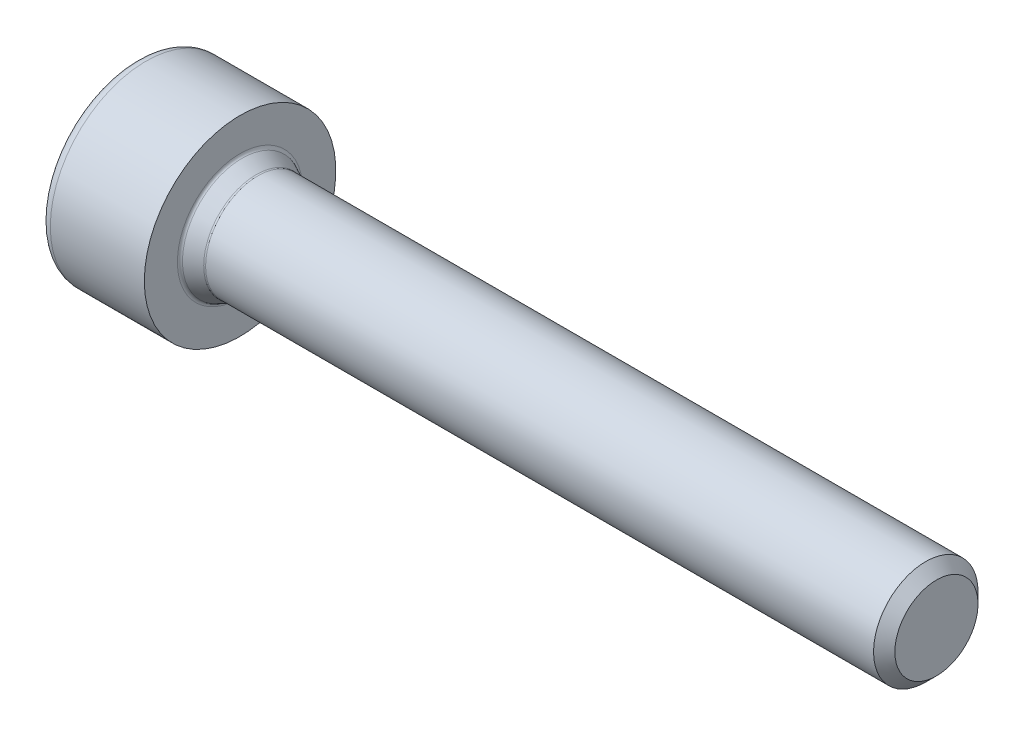
ISO-10303-21;
HEADER;
FILE_DESCRIPTION(('STEP AP214'),'2;1');
FILE_NAME('part.step','',(''),(''),'','','');
FILE_SCHEMA(('AUTOMOTIVE_DESIGN { 1 0 10303 214 1 1 1 1 }'));
ENDSEC;
DATA;
#1=APPLICATION_CONTEXT('core data for automotive mechanical design processes');
#2=APPLICATION_PROTOCOL_DEFINITION('international standard','automotive_design',2000,#1);
#3=PRODUCT_CONTEXT('',#1,'mechanical');
#4=PRODUCT('Part','Part','',(#3));
#5=PRODUCT_RELATED_PRODUCT_CATEGORY('part','',(#4));
#6=PRODUCT_DEFINITION_FORMATION('','',#4);
#7=PRODUCT_DEFINITION_CONTEXT('part definition',#1,'design');
#8=PRODUCT_DEFINITION('design','',#6,#7);
#9=PRODUCT_DEFINITION_SHAPE('','',#8);
#10=(LENGTH_UNIT() NAMED_UNIT(*) SI_UNIT(.MILLI.,.METRE.));
#11=(NAMED_UNIT(*) PLANE_ANGLE_UNIT() SI_UNIT($,.RADIAN.));
#12=(NAMED_UNIT(*) SI_UNIT($,.STERADIAN.) SOLID_ANGLE_UNIT());
#13=UNCERTAINTY_MEASURE_WITH_UNIT(LENGTH_MEASURE(1.E-05),#10,'distance_accuracy_value','');
#14=(GEOMETRIC_REPRESENTATION_CONTEXT(3) GLOBAL_UNCERTAINTY_ASSIGNED_CONTEXT((#13)) GLOBAL_UNIT_ASSIGNED_CONTEXT((#10,
#11,#12)) REPRESENTATION_CONTEXT('',''));
#15=CARTESIAN_POINT('',(0.,0.,0.));
#16=DIRECTION('',(0.,0.,1.));
#17=DIRECTION('',(1.,0.,0.));
#18=AXIS2_PLACEMENT_3D('',#15,#16,#17);
#19=CARTESIAN_POINT('',(-1.15,1.44337567297406,0.));
#20=DIRECTION('',(0.,0.866025403784439,0.5));
#21=DIRECTION('',(0.,-0.5,0.866025403784439));
#22=AXIS2_PLACEMENT_3D('',#19,#20,#21);
#23=PLANE('',#22);
#24=DIRECTION('',(1.,0.,0.));
#25=VECTOR('',#24,1.);
#26=CARTESIAN_POINT('',(-1.15,1.44337567297406,0.));
#27=LINE('',#26,#25);
#28=CARTESIAN_POINT('',(-3.,1.44337567297406,0.));
#29=VERTEX_POINT('',#28);
#30=CARTESIAN_POINT('',(-1.15,1.44337567297406,0.));
#31=VERTEX_POINT('',#30);
#32=EDGE_CURVE('E113',#29,#31,#27,.T.);
#33=ORIENTED_EDGE('',*,*,#32,.T.);
#34=DIRECTION('',(0.,-0.5,0.866025403784439));
#35=VECTOR('',#34,1.);
#36=CARTESIAN_POINT('',(-1.15,1.44337567297406,0.));
#37=LINE('',#36,#35);
#38=CARTESIAN_POINT('',(-1.15,0.721687836487032,1.25));
#39=VERTEX_POINT('',#38);
#40=EDGE_CURVE('E101',#39,#31,#37,.F.);
#41=ORIENTED_EDGE('',*,*,#40,.F.);
#42=DIRECTION('',(1.,0.,0.));
#43=VECTOR('',#42,1.);
#44=CARTESIAN_POINT('',(-1.15,0.721687836487032,1.25));
#45=LINE('',#44,#43);
#46=CARTESIAN_POINT('',(-3.,0.721687836487032,1.25));
#47=VERTEX_POINT('',#46);
#48=EDGE_CURVE('E99',#39,#47,#45,.F.);
#49=ORIENTED_EDGE('',*,*,#48,.T.);
#50=DIRECTION('',(0.,-0.5,0.866025403784439));
#51=VECTOR('',#50,1.);
#52=CARTESIAN_POINT('',(-3.,1.44337567297406,0.));
#53=LINE('',#52,#51);
#54=CARTESIAN_POINT('',(-3.00000000001217,0.730138153725119,1.23536362120356));
#55=VERTEX_POINT('',#54);
#56=EDGE_CURVE('E88',#55,#47,#53,.T.);
#57=ORIENTED_EDGE('',*,*,#56,.F.);
#58=CARTESIAN_POINT('',(-2.99999999998104,1.43492535570608,0.0146363788507577));
#59=CARTESIAN_POINT('',(-2.97614422369758,1.41061933872002,0.0567356351986281));
#60=CARTESIAN_POINT('',(-2.95372895410129,1.38591202091713,0.0995299649513145));
#61=CARTESIAN_POINT('',(-2.91275824019961,1.33556014659485,0.186741969533327));
#62=CARTESIAN_POINT('',(-2.89422444681304,1.30991122428466,0.231167206134148));
#63=CARTESIAN_POINT('',(-2.86251893332919,1.25819744032306,0.320738107407409));
#64=CARTESIAN_POINT('',(-2.84927080537774,1.2321446250199,0.365862907192652));
#65=CARTESIAN_POINT('',(-2.82890288179569,1.17948997052625,0.457063444030607));
#66=CARTESIAN_POINT('',(-2.82176877882099,1.15288956308614,0.503136701218909));
#67=CARTESIAN_POINT('',(-2.81531818799297,1.10662680515451,0.583266148454772));
#68=CARTESIAN_POINT('',(-2.81441787116884,1.08701763674765,0.617230224429627));
#69=CARTESIAN_POINT('',(-2.81631201717714,1.04783836523914,0.685090713285895));
#70=CARTESIAN_POINT('',(-2.81910735784838,1.02826827252522,0.718987108175235));
#71=CARTESIAN_POINT('',(-2.82823104113181,0.989322680676551,0.786442851987974));
#72=CARTESIAN_POINT('',(-2.83456230525513,0.969947355960118,0.82000189880998));
#73=CARTESIAN_POINT('',(-2.85041837518595,0.931522584480777,0.886555555281422));
#74=CARTESIAN_POINT('',(-2.85994451235766,0.912473277059478,0.91954992358411));
#75=CARTESIAN_POINT('',(-2.88717720353795,0.865404269274825,1.00107583652899));
#76=CARTESIAN_POINT('',(-2.9065958401645,0.837635822929059,1.0491721964471));
#77=CARTESIAN_POINT('',(-2.95013015716089,0.783131175523178,1.14357701500272));
#78=CARTESIAN_POINT('',(-2.97423015985955,0.756391876443108,1.18989083956818));
#79=CARTESIAN_POINT('',(-2.99999999998164,0.7301381537562,1.23536362114972));
#80=B_SPLINE_CURVE_WITH_KNOTS('',3,(#58,#59,#60,#61,#62,#63,#64,#65,#66,#67,#68,#69,#70,#71,#72,
#73,#74,#75,#76,#77,#78,#79),.UNSPECIFIED.,.F.,.F.,(4,2,2,2,2,2,2,2,2,2,4),(0.,0.16255676109928,
0.325997439633078,0.486981513157489,0.647587833378342,0.765107082751543,0.88265425178377,
1.00029868663939,1.11799220720352,1.2942288438708,1.46988514303168),.UNSPECIFIED.);
#81=CARTESIAN_POINT('',(-3.00000000002137,1.43492535574535,0.0146363787802106));
#82=VERTEX_POINT('',#81);
#83=EDGE_CURVE('E19',#82,#55,#80,.T.);
#84=ORIENTED_EDGE('',*,*,#83,.F.);
#85=DIRECTION('',(0.,-0.5,0.866025403784439));
#86=VECTOR('',#85,1.);
#87=CARTESIAN_POINT('',(-3.,1.44337567297406,0.));
#88=LINE('',#87,#86);
#89=EDGE_CURVE('E79',#29,#82,#88,.T.);
#90=ORIENTED_EDGE('',*,*,#89,.F.);
#91=EDGE_LOOP('',(#33,#41,#49,#57,#84,#90));
#92=FACE_BOUND('',#91,.T.);
#93=ADVANCED_FACE('F15',(#92),#23,.F.);
#94=CARTESIAN_POINT('',(-1.15,0.721687836487032,-1.25));
#95=DIRECTION('',(0.,0.866025403784439,-0.5));
#96=DIRECTION('',(0.,0.5,0.866025403784439));
#97=AXIS2_PLACEMENT_3D('',#94,#95,#96);
#98=PLANE('',#97);
#99=DIRECTION('',(-1.,0.,0.));
#100=VECTOR('',#99,1.);
#101=CARTESIAN_POINT('',(-1.15,0.721687836487032,-1.25));
#102=LINE('',#101,#100);
#103=CARTESIAN_POINT('',(-3.,0.721687836487032,-1.25));
#104=VERTEX_POINT('',#103);
#105=CARTESIAN_POINT('',(-1.15,0.721687836487032,-1.25));
#106=VERTEX_POINT('',#105);
#107=EDGE_CURVE('E333',#104,#106,#102,.F.);
#108=ORIENTED_EDGE('',*,*,#107,.T.);
#109=DIRECTION('',(0.,0.5,0.866025403784439));
#110=VECTOR('',#109,1.);
#111=CARTESIAN_POINT('',(-1.15,0.721687836487032,-1.25));
#112=LINE('',#111,#110);
#113=EDGE_CURVE('E115',#31,#106,#112,.F.);
#114=ORIENTED_EDGE('',*,*,#113,.F.);
#115=ORIENTED_EDGE('',*,*,#32,.F.);
#116=DIRECTION('',(0.,0.5,0.866025403784439));
#117=VECTOR('',#116,1.);
#118=CARTESIAN_POINT('',(-3.,0.721687836487032,-1.25));
#119=LINE('',#118,#117);
#120=CARTESIAN_POINT('',(-3.00000000001217,1.43492535573598,-0.0146363787964418));
#121=VERTEX_POINT('',#120);
#122=EDGE_CURVE('E116',#121,#29,#119,.T.);
#123=ORIENTED_EDGE('',*,*,#122,.F.);
#124=CARTESIAN_POINT('',(-2.99999999998104,0.73013815375721,-1.23536362115051));
#125=CARTESIAN_POINT('',(-2.97614422369758,0.754444170741868,-1.19326436480183));
#126=CARTESIAN_POINT('',(-2.95372895410129,0.779151488544179,-1.15047003504881));
#127=CARTESIAN_POINT('',(-2.91275824019961,0.829503362866029,-1.06325803046655));
#128=CARTESIAN_POINT('',(-2.89422444681304,0.855152285176378,-1.01883279386582));
#129=CARTESIAN_POINT('',(-2.86251893332919,0.90686606913809,-0.929261892592623));
#130=CARTESIAN_POINT('',(-2.84927080537774,0.932918884441215,-0.884137092807356));
#131=CARTESIAN_POINT('',(-2.82890288179569,0.985573538934836,-0.792936555969384));
#132=CARTESIAN_POINT('',(-2.82176877882099,1.01217394637495,-0.746863298781089));
#133=CARTESIAN_POINT('',(-2.81531818799297,1.05843670430659,-0.666733851545229));
#134=CARTESIAN_POINT('',(-2.81441787116884,1.07804587271345,-0.632769775570373));
#135=CARTESIAN_POINT('',(-2.81631201717714,1.11722514422196,-0.564909286714104));
#136=CARTESIAN_POINT('',(-2.81910735784838,1.13679523693588,-0.531012891824764));
#137=CARTESIAN_POINT('',(-2.82823104113181,1.17574082878455,-0.463557148012026));
#138=CARTESIAN_POINT('',(-2.83456230525513,1.19511615350098,-0.42999810119002));
#139=CARTESIAN_POINT('',(-2.85041837518595,1.23354092498032,-0.363444444718578));
#140=CARTESIAN_POINT('',(-2.85994451235766,1.25259023240162,-0.330450076415889));
#141=CARTESIAN_POINT('',(-2.88717720353795,1.29965924018627,-0.248924163471014));
#142=CARTESIAN_POINT('',(-2.9065958401645,1.32742768653204,-0.200827803552898));
#143=CARTESIAN_POINT('',(-2.95013015716089,1.38193233393792,-0.106422984997284));
#144=CARTESIAN_POINT('',(-2.97423015985955,1.40867163301799,-0.0601091604318232));
#145=CARTESIAN_POINT('',(-2.99999999998164,1.4349253557049,-0.0146363788502751));
#146=B_SPLINE_CURVE_WITH_KNOTS('',3,(#124,#125,#126,#127,#128,#129,#130,#131,#132,#133,#134,
#135,#136,#137,#138,#139,#140,#141,#142,#143,#144,#145),.UNSPECIFIED.,.F.,.F.,(4,2,2,2,2,2,2,2,
2,2,4),(0.,0.16255676109928,0.325997439633078,0.48698151315749,0.647587833378342,
0.765107082751544,0.88265425178377,1.00029868663939,1.11799220720352,1.2942288438708,
1.46988514303168),.UNSPECIFIED.);
#147=CARTESIAN_POINT('',(-3.00000000002137,0.730138153715748,-1.23536362121979));
#148=VERTEX_POINT('',#147);
#149=EDGE_CURVE('E193',#148,#121,#146,.T.);
#150=ORIENTED_EDGE('',*,*,#149,.F.);
#151=DIRECTION('',(0.,0.5,0.866025403784439));
#152=VECTOR('',#151,1.);
#153=CARTESIAN_POINT('',(-3.,0.721687836487032,-1.25));
#154=LINE('',#153,#152);
#155=EDGE_CURVE('E357',#104,#148,#154,.T.);
#156=ORIENTED_EDGE('',*,*,#155,.F.);
#157=EDGE_LOOP('',(#108,#114,#115,#123,#150,#156));
#158=FACE_BOUND('',#157,.T.);
#159=ADVANCED_FACE('F207',(#158),#98,.F.);
#160=CARTESIAN_POINT('',(-0.462678250983117,0.,-5.6843418860808E-11));
#161=DIRECTION('',(-1.,0.,0.));
#162=DIRECTION('',(0.,0.,1.));
#163=AXIS2_PLACEMENT_3D('',#160,#161,#162);
#164=CONICAL_SURFACE('',#163,0.,1.04719755120469);
#165=CARTESIAN_POINT('',(-0.462678250983117,0.,0.));
#166=VERTEX_POINT('',#165);
#167=VERTEX_LOOP('',#166);
#168=FACE_BOUND('',#167,.T.);
#169=CARTESIAN_POINT('',(-1.14999999999554,0.,-5.6843418860808E-11));
#170=DIRECTION('',(-1.,0.,0.));
#171=DIRECTION('',(0.,0.,1.));
#172=AXIS2_PLACEMENT_3D('',#169,#170,#171);
#173=CIRCLE('',#172,1.19047619045887);
#174=CARTESIAN_POINT('',(-1.14999999999554,0.,1.19047619040202));
#175=VERTEX_POINT('',#174);
#176=EDGE_CURVE('E328',#175,#175,#173,.T.);
#177=ORIENTED_EDGE('',*,*,#176,.T.);
#178=EDGE_LOOP('',(#177));
#179=FACE_BOUND('',#178,.T.);
#180=ADVANCED_FACE('F202',(#168,#179),#164,.F.);
#181=CARTESIAN_POINT('',(-1.15,0.721687836487032,1.25));
#182=DIRECTION('',(0.,0.,1.));
#183=DIRECTION('',(1.,0.,0.));
#184=AXIS2_PLACEMENT_3D('',#181,#182,#183);
#185=PLANE('',#184);
#186=CARTESIAN_POINT('',(-2.99999999998104,0.704787201948871,1.25000000000127));
#187=CARTESIAN_POINT('',(-2.97614422369758,0.65617516797815,1.25000000000046));
#188=CARTESIAN_POINT('',(-2.95372895410129,0.606760532372951,1.25000000000012));
#189=CARTESIAN_POINT('',(-2.91275824019961,0.506056783728826,1.24999999999988));
#190=CARTESIAN_POINT('',(-2.89422444681304,0.454758939108285,1.24999999999997));
#191=CARTESIAN_POINT('',(-2.86251893332919,0.351331371184973,1.25000000000003));
#192=CARTESIAN_POINT('',(-2.84927080537774,0.299225740578682,1.25000000000001));
#193=CARTESIAN_POINT('',(-2.82890288179569,0.19391643159141,1.24999999999999));
#194=CARTESIAN_POINT('',(-2.82176877882099,0.140715616711196,1.25));
#195=CARTESIAN_POINT('',(-2.81531818799297,0.0481901008479147,1.25));
#196=CARTESIAN_POINT('',(-2.81441787116884,0.00897176403419511,1.25));
#197=CARTESIAN_POINT('',(-2.81631201717714,-0.0693867789828172,1.25));
#198=CARTESIAN_POINT('',(-2.81910735784838,-0.108526964410654,1.25));
#199=CARTESIAN_POINT('',(-2.82823104113181,-0.186418148107996,1.25));
#200=CARTESIAN_POINT('',(-2.83456230525513,-0.225168797540861,1.25));
#201=CARTESIAN_POINT('',(-2.85041837518595,-0.302018340499543,1.25));
#202=CARTESIAN_POINT('',(-2.85994451235766,-0.34011695534214,1.25));
#203=CARTESIAN_POINT('',(-2.88717720353795,-0.434254970911448,1.25));
#204=CARTESIAN_POINT('',(-2.9065958401645,-0.489791863602979,1.25));
#205=CARTESIAN_POINT('',(-2.95013015716089,-0.598801158414741,1.25));
#206=CARTESIAN_POINT('',(-2.97423015985955,-0.652279756574881,1.25));
#207=CARTESIAN_POINT('',(-2.99999999998164,-0.704787201948696,1.25));
#208=B_SPLINE_CURVE_WITH_KNOTS('',3,(#186,#187,#188,#189,#190,#191,#192,#193,#194,#195,#196,
#197,#198,#199,#200,#201,#202,#203,#204,#205,#206,#207),.UNSPECIFIED.,.F.,.F.,(4,2,2,2,2,2,2,2,
2,2,4),(0.,0.16255676109928,0.325997439633078,0.48698151315749,0.647587833378342,
0.765107082751544,0.88265425178377,1.00029868663939,1.11799220720352,1.2942288438708,
1.46988514303168),.UNSPECIFIED.);
#209=CARTESIAN_POINT('',(-3.00000000002137,0.7047872020296,1.25));
#210=VERTEX_POINT('',#209);
#211=CARTESIAN_POINT('',(-3.00000000001217,-0.704787202010858,1.25));
#212=VERTEX_POINT('',#211);
#213=EDGE_CURVE('E180',#210,#212,#208,.T.);
#214=ORIENTED_EDGE('',*,*,#213,.F.);
#215=DIRECTION('',(0.,1.,0.));
#216=VECTOR('',#215,1.);
#217=CARTESIAN_POINT('',(-3.,0.721687836487032,1.25));
#218=LINE('',#217,#216);
#219=EDGE_CURVE('E187',#47,#210,#218,.F.);
#220=ORIENTED_EDGE('',*,*,#219,.F.);
#221=ORIENTED_EDGE('',*,*,#48,.F.);
#222=DIRECTION('',(0.,1.,0.));
#223=VECTOR('',#222,1.);
#224=CARTESIAN_POINT('',(-1.15,0.,1.25));
#225=LINE('',#224,#223);
#226=CARTESIAN_POINT('',(-1.15,-0.721687836487032,1.25));
#227=VERTEX_POINT('',#226);
#228=EDGE_CURVE('E318',#39,#227,#225,.F.);
#229=ORIENTED_EDGE('',*,*,#228,.T.);
#230=DIRECTION('',(1.,0.,0.));
#231=VECTOR('',#230,1.);
#232=CARTESIAN_POINT('',(-1.15,-0.721687836487032,1.25));
#233=LINE('',#232,#231);
#234=CARTESIAN_POINT('',(-3.,-0.721687836487032,1.25));
#235=VERTEX_POINT('',#234);
#236=EDGE_CURVE('E312',#227,#235,#233,.F.);
#237=ORIENTED_EDGE('',*,*,#236,.T.);
#238=DIRECTION('',(0.,1.,0.));
#239=VECTOR('',#238,1.);
#240=CARTESIAN_POINT('',(-3.,0.721687836487032,1.25));
#241=LINE('',#240,#239);
#242=EDGE_CURVE('E186',#212,#235,#241,.F.);
#243=ORIENTED_EDGE('',*,*,#242,.F.);
#244=EDGE_LOOP('',(#214,#220,#221,#229,#237,#243));
#245=FACE_BOUND('',#244,.T.);
#246=ADVANCED_FACE('F197',(#245),#185,.F.);
#247=CARTESIAN_POINT('',(-1.15,-0.721687836487032,-1.25));
#248=DIRECTION('',(0.,0.,-1.));
#249=DIRECTION('',(-1.,0.,0.));
#250=AXIS2_PLACEMENT_3D('',#247,#248,#249);
#251=PLANE('',#250);
#252=DIRECTION('',(1.,0.,0.));
#253=VECTOR('',#252,1.);
#254=CARTESIAN_POINT('',(-1.15,-0.721687836487032,-1.25));
#255=LINE('',#254,#253);
#256=CARTESIAN_POINT('',(-3.,-0.721687836487032,-1.25));
#257=VERTEX_POINT('',#256);
#258=CARTESIAN_POINT('',(-1.15,-0.721687836487032,-1.25));
#259=VERTEX_POINT('',#258);
#260=EDGE_CURVE('E296',#257,#259,#255,.T.);
#261=ORIENTED_EDGE('',*,*,#260,.T.);
#262=DIRECTION('',(0.,1.,0.));
#263=VECTOR('',#262,1.);
#264=CARTESIAN_POINT('',(-1.15,0.,-1.25));
#265=LINE('',#264,#263);
#266=EDGE_CURVE('E325',#259,#106,#265,.T.);
#267=ORIENTED_EDGE('',*,*,#266,.T.);
#268=ORIENTED_EDGE('',*,*,#107,.F.);
#269=DIRECTION('',(0.,1.,0.));
#270=VECTOR('',#269,1.);
#271=CARTESIAN_POINT('',(-3.,-0.721687836487032,-1.25));
#272=LINE('',#271,#270);
#273=CARTESIAN_POINT('',(-3.00000000001217,0.704787202010857,-1.25));
#274=VERTEX_POINT('',#273);
#275=EDGE_CURVE('E336',#274,#104,#272,.T.);
#276=ORIENTED_EDGE('',*,*,#275,.F.);
#277=CARTESIAN_POINT('',(-2.99999999998104,-0.70478720194887,-1.25000000000127));
#278=CARTESIAN_POINT('',(-2.97614422369758,-0.65617516797815,-1.25000000000046));
#279=CARTESIAN_POINT('',(-2.95372895410129,-0.606760532372951,-1.25000000000012));
#280=CARTESIAN_POINT('',(-2.91275824019961,-0.506056783728825,-1.24999999999988));
#281=CARTESIAN_POINT('',(-2.89422444681304,-0.454758939108284,-1.24999999999997));
#282=CARTESIAN_POINT('',(-2.86251893332919,-0.351331371184972,-1.25000000000003));
#283=CARTESIAN_POINT('',(-2.84927080537774,-0.299225740578682,-1.25000000000001));
#284=CARTESIAN_POINT('',(-2.82890288179569,-0.19391643159141,-1.24999999999999));
#285=CARTESIAN_POINT('',(-2.82176877882099,-0.140715616711196,-1.25));
#286=CARTESIAN_POINT('',(-2.81531818799297,-0.048190100847915,-1.25));
#287=CARTESIAN_POINT('',(-2.81441787116884,-0.0089717640341955,-1.25));
#288=CARTESIAN_POINT('',(-2.81631201717714,0.0693867789828167,-1.25));
#289=CARTESIAN_POINT('',(-2.81910735784838,0.108526964410654,-1.25));
#290=CARTESIAN_POINT('',(-2.82823104113181,0.186418148107996,-1.25));
#291=CARTESIAN_POINT('',(-2.83456230525513,0.225168797540861,-1.25));
#292=CARTESIAN_POINT('',(-2.85041837518595,0.302018340499543,-1.25));
#293=CARTESIAN_POINT('',(-2.85994451235766,0.34011695534214,-1.25));
#294=CARTESIAN_POINT('',(-2.88717720353795,0.434254970911448,-1.25));
#295=CARTESIAN_POINT('',(-2.9065958401645,0.489791863602978,-1.25));
#296=CARTESIAN_POINT('',(-2.95013015716089,0.598801158414741,-1.25));
#297=CARTESIAN_POINT('',(-2.97423015985955,0.652279756574881,-1.25));
#298=CARTESIAN_POINT('',(-2.99999999998164,0.704787201948696,-1.25));
#299=B_SPLINE_CURVE_WITH_KNOTS('',3,(#277,#278,#279,#280,#281,#282,#283,#284,#285,#286,#287,
#288,#289,#290,#291,#292,#293,#294,#295,#296,#297,#298),.UNSPECIFIED.,.F.,.F.,(4,2,2,2,2,2,2,2,
2,2,4),(0.,0.16255676109928,0.325997439633078,0.486981513157489,0.647587833378342,
0.765107082751543,0.88265425178377,1.00029868663939,1.11799220720352,1.2942288438708,
1.46988514303168),.UNSPECIFIED.);
#300=CARTESIAN_POINT('',(-3.00000000002137,-0.7047872020296,-1.25));
#301=VERTEX_POINT('',#300);
#302=EDGE_CURVE('E188',#301,#274,#299,.T.);
#303=ORIENTED_EDGE('',*,*,#302,.F.);
#304=DIRECTION('',(0.,1.,0.));
#305=VECTOR('',#304,1.);
#306=CARTESIAN_POINT('',(-3.,-0.721687836487032,-1.25));
#307=LINE('',#306,#305);
#308=EDGE_CURVE('E331',#257,#301,#307,.T.);
#309=ORIENTED_EDGE('',*,*,#308,.F.);
#310=EDGE_LOOP('',(#261,#267,#268,#276,#303,#309));
#311=FACE_BOUND('',#310,.T.);
#312=ADVANCED_FACE('F201',(#311),#251,.F.);
#313=CARTESIAN_POINT('',(-1.15,0.,0.));
#314=DIRECTION('',(1.,0.,0.));
#315=DIRECTION('',(0.,0.,-1.));
#316=AXIS2_PLACEMENT_3D('',#313,#314,#315);
#317=PLANE('',#316);
#318=ORIENTED_EDGE('',*,*,#40,.T.);
#319=ORIENTED_EDGE('',*,*,#113,.T.);
#320=ORIENTED_EDGE('',*,*,#266,.F.);
#321=DIRECTION('',(0.,0.5,-0.866025403784439));
#322=VECTOR('',#321,1.);
#323=CARTESIAN_POINT('',(-1.15,-1.44337567297406,0.));
#324=LINE('',#323,#322);
#325=CARTESIAN_POINT('',(-1.15,-1.44337567297406,0.));
#326=VERTEX_POINT('',#325);
#327=EDGE_CURVE('E299',#259,#326,#324,.F.);
#328=ORIENTED_EDGE('',*,*,#327,.T.);
#329=DIRECTION('',(0.,-0.5,-0.866025403784439));
#330=VECTOR('',#329,1.);
#331=CARTESIAN_POINT('',(-1.15,-0.721687836487032,1.25));
#332=LINE('',#331,#330);
#333=EDGE_CURVE('E315',#326,#227,#332,.F.);
#334=ORIENTED_EDGE('',*,*,#333,.T.);
#335=ORIENTED_EDGE('',*,*,#228,.F.);
#336=EDGE_LOOP('',(#318,#319,#320,#328,#334,#335));
#337=FACE_BOUND('',#336,.T.);
#338=ORIENTED_EDGE('',*,*,#176,.F.);
#339=EDGE_LOOP('',(#338));
#340=FACE_BOUND('',#339,.T.);
#341=ADVANCED_FACE('F417',(#337,#340),#317,.F.);
#342=CARTESIAN_POINT('',(-1.15,-0.721687836487032,1.25));
#343=DIRECTION('',(0.,-0.866025403784439,0.5));
#344=DIRECTION('',(0.,-0.5,-0.866025403784439));
#345=AXIS2_PLACEMENT_3D('',#342,#343,#344);
#346=PLANE('',#345);
#347=CARTESIAN_POINT('',(-2.99999999998104,-0.73013815375721,1.23536362115051));
#348=CARTESIAN_POINT('',(-2.97614422369758,-0.754444170741868,1.19326436480183));
#349=CARTESIAN_POINT('',(-2.95372895410129,-0.779151488544179,1.15047003504881));
#350=CARTESIAN_POINT('',(-2.91275824019961,-0.829503362866029,1.06325803046655));
#351=CARTESIAN_POINT('',(-2.89422444681304,-0.855152285176378,1.01883279386582));
#352=CARTESIAN_POINT('',(-2.86251893332919,-0.90686606913809,0.929261892592623));
#353=CARTESIAN_POINT('',(-2.84927080537774,-0.932918884441215,0.884137092807355));
#354=CARTESIAN_POINT('',(-2.82890288179569,-0.985573538934836,0.792936555969384));
#355=CARTESIAN_POINT('',(-2.82176877882099,-1.01217394637495,0.746863298781089));
#356=CARTESIAN_POINT('',(-2.81531818799297,-1.05843670430659,0.666733851545229));
#357=CARTESIAN_POINT('',(-2.81441787116884,-1.07804587271345,0.632769775570373));
#358=CARTESIAN_POINT('',(-2.81631201717714,-1.11722514422196,0.564909286714104));
#359=CARTESIAN_POINT('',(-2.81910735784838,-1.13679523693588,0.531012891824764));
#360=CARTESIAN_POINT('',(-2.82823104113181,-1.17574082878455,0.463557148012026));
#361=CARTESIAN_POINT('',(-2.83456230525513,-1.19511615350098,0.429998101190019));
#362=CARTESIAN_POINT('',(-2.85041837518595,-1.23354092498032,0.363444444718577));
#363=CARTESIAN_POINT('',(-2.85994451235766,-1.25259023240162,0.330450076415889));
#364=CARTESIAN_POINT('',(-2.88717720353795,-1.29965924018627,0.248924163471014));
#365=CARTESIAN_POINT('',(-2.9065958401645,-1.32742768653204,0.200827803552898));
#366=CARTESIAN_POINT('',(-2.95013015716089,-1.38193233393792,0.106422984997284));
#367=CARTESIAN_POINT('',(-2.97423015985955,-1.40867163301799,0.0601091604318233));
#368=CARTESIAN_POINT('',(-2.99999999998164,-1.4349253557049,0.0146363788502754));
#369=B_SPLINE_CURVE_WITH_KNOTS('',3,(#347,#348,#349,#350,#351,#352,#353,#354,#355,#356,#357,
#358,#359,#360,#361,#362,#363,#364,#365,#366,#367,#368),.UNSPECIFIED.,.F.,.F.,(4,2,2,2,2,2,2,2,
2,2,4),(0.,0.16255676109928,0.325997439633078,0.48698151315749,0.647587833378343,
0.765107082751544,0.882654251783771,1.00029868663939,1.11799220720353,1.2942288438708,
1.46988514303168),.UNSPECIFIED.);
#370=CARTESIAN_POINT('',(-3.00000000002137,-0.730138153715748,1.23536362121979));
#371=VERTEX_POINT('',#370);
#372=CARTESIAN_POINT('',(-3.00000000001217,-1.43492535573598,0.0146363787964418));
#373=VERTEX_POINT('',#372);
#374=EDGE_CURVE('E151',#371,#373,#369,.T.);
#375=ORIENTED_EDGE('',*,*,#374,.F.);
#376=DIRECTION('',(0.,-0.5,-0.866025403784439));
#377=VECTOR('',#376,1.);
#378=CARTESIAN_POINT('',(-3.,-0.721687836487032,1.25));
#379=LINE('',#378,#377);
#380=EDGE_CURVE('E310',#235,#371,#379,.T.);
#381=ORIENTED_EDGE('',*,*,#380,.F.);
#382=ORIENTED_EDGE('',*,*,#236,.F.);
#383=ORIENTED_EDGE('',*,*,#333,.F.);
#384=DIRECTION('',(1.,0.,0.));
#385=VECTOR('',#384,1.);
#386=CARTESIAN_POINT('',(-1.15,-1.44337567297406,0.));
#387=LINE('',#386,#385);
#388=CARTESIAN_POINT('',(-3.,-1.44337567297406,0.));
#389=VERTEX_POINT('',#388);
#390=EDGE_CURVE('E293',#326,#389,#387,.F.);
#391=ORIENTED_EDGE('',*,*,#390,.T.);
#392=DIRECTION('',(0.,-0.5,-0.866025403784439));
#393=VECTOR('',#392,1.);
#394=CARTESIAN_POINT('',(-3.,-0.721687836487032,1.25));
#395=LINE('',#394,#393);
#396=EDGE_CURVE('E300',#373,#389,#395,.T.);
#397=ORIENTED_EDGE('',*,*,#396,.F.);
#398=EDGE_LOOP('',(#375,#381,#382,#383,#391,#397));
#399=FACE_BOUND('',#398,.T.);
#400=ADVANCED_FACE('F425',(#399),#346,.F.);
#401=CARTESIAN_POINT('',(-1.15,-1.44337567297406,0.));
#402=DIRECTION('',(0.,-0.866025403784439,-0.5));
#403=DIRECTION('',(0.,0.5,-0.866025403784439));
#404=AXIS2_PLACEMENT_3D('',#401,#402,#403);
#405=PLANE('',#404);
#406=CARTESIAN_POINT('',(-2.99999999998326,-1.4349253557153,-0.014636378844587));
#407=CARTESIAN_POINT('',(-2.97614422370064,-1.41061933872587,-0.0567356351920171));
#408=CARTESIAN_POINT('',(-2.95372895410438,-1.38591202092139,-0.0995299649448835));
#409=CARTESIAN_POINT('',(-2.9127582402021,-1.33556014659746,-0.186741969527869));
#410=CARTESIAN_POINT('',(-2.89422444681489,-1.30991122428721,-0.231167206129487));
#411=CARTESIAN_POINT('',(-2.86251893333011,-1.25819744032504,-0.320738107404241));
#412=CARTESIAN_POINT('',(-2.84927080537836,-1.23214462502136,-0.365862907190182));
#413=CARTESIAN_POINT('',(-2.82890288179585,-1.17948997052679,-0.457063444029594));
#414=CARTESIAN_POINT('',(-2.82176877882099,-1.15288956308628,-0.503136701218656));
#415=CARTESIAN_POINT('',(-2.81531818799294,-1.10662680515418,-0.583266148455357));
#416=CARTESIAN_POINT('',(-2.81441787116883,-1.08701763674727,-0.617230224430288));
#417=CARTESIAN_POINT('',(-2.81631201717718,-1.04783836523867,-0.685090713286707));
#418=CARTESIAN_POINT('',(-2.81910735784847,-1.02826827252471,-0.718987108176123));
#419=CARTESIAN_POINT('',(-2.82823104113198,-0.989322680675957,-0.786442851989003));
#420=CARTESIAN_POINT('',(-2.83456230525535,-0.969947355959487,-0.820001898811074));
#421=CARTESIAN_POINT('',(-2.85041837518628,-0.931522584480073,-0.886555555282642));
#422=CARTESIAN_POINT('',(-2.85994451235805,-0.912473277058739,-0.919549923585391));
#423=CARTESIAN_POINT('',(-2.88717720353886,-0.865404269273364,-1.00107583653152));
#424=CARTESIAN_POINT('',(-2.90659584016601,-0.837635822926935,-1.04917219645078));
#425=CARTESIAN_POINT('',(-2.95013015716381,-0.783131175519765,-1.14357701500863));
#426=CARTESIAN_POINT('',(-2.97423015986326,-0.75639187643907,-1.18989083957517));
#427=CARTESIAN_POINT('',(-2.9999999999862,-0.73013815375156,-1.23536362115776));
#428=B_SPLINE_CURVE_WITH_KNOTS('',3,(#406,#407,#408,#409,#410,#411,#412,#413,#414,#415,#416,
#417,#418,#419,#420,#421,#422,#423,#424,#425,#426,#427),.UNSPECIFIED.,.F.,.F.,(4,2,2,2,2,2,2,2,
2,2,4),(0.,0.162556761101842,0.325997439638349,0.486981513165443,0.647587833388914,
0.76510708276238,0.882654251794874,1.00029868665074,1.11799220721512,1.29422884388674,
1.469885143052),.UNSPECIFIED.);
#429=CARTESIAN_POINT('',(-3.00000000001435,-1.4349253557382,-0.0146363787925877));
#430=VERTEX_POINT('',#429);
#431=CARTESIAN_POINT('',(-3.00000000001435,-0.730138153722894,-1.23536362120741));
#432=VERTEX_POINT('',#431);
#433=EDGE_CURVE('E142',#430,#432,#428,.T.);
#434=ORIENTED_EDGE('',*,*,#433,.F.);
#435=DIRECTION('',(0.,0.5,-0.866025403784439));
#436=VECTOR('',#435,1.);
#437=CARTESIAN_POINT('',(-3.,-1.44337567297406,0.));
#438=LINE('',#437,#436);
#439=EDGE_CURVE('E38',#389,#430,#438,.T.);
#440=ORIENTED_EDGE('',*,*,#439,.F.);
#441=ORIENTED_EDGE('',*,*,#390,.F.);
#442=ORIENTED_EDGE('',*,*,#327,.F.);
#443=ORIENTED_EDGE('',*,*,#260,.F.);
#444=DIRECTION('',(0.,0.5,-0.866025403784439));
#445=VECTOR('',#444,1.);
#446=CARTESIAN_POINT('',(-3.,-1.44337567297406,0.));
#447=LINE('',#446,#445);
#448=EDGE_CURVE('E150',#432,#257,#447,.T.);
#449=ORIENTED_EDGE('',*,*,#448,.F.);
#450=EDGE_LOOP('',(#434,#440,#441,#442,#443,#449));
#451=FACE_BOUND('',#450,.T.);
#452=ADVANCED_FACE('F158',(#451),#405,.F.);
#453=CARTESIAN_POINT('',(-1.56499999997095,0.,0.));
#454=DIRECTION('',(-1.,0.,0.));
#455=DIRECTION('',(0.,-1.,0.));
#456=AXIS2_PLACEMENT_3D('',#453,#454,#455);
#457=CONICAL_SURFACE('',#456,0.,0.785398163397448);
#458=CARTESIAN_POINT('',(-1.56499999997095,0.,0.));
#459=VERTEX_POINT('',#458);
#460=VERTEX_LOOP('',#459);
#461=FACE_BOUND('',#460,.T.);
#462=ORIENTED_EDGE('',*,*,#302,.T.);
#463=CARTESIAN_POINT('',(-3.00000000004275,0.,0.));
#464=DIRECTION('',(-1.,0.,0.));
#465=DIRECTION('',(0.,-1.,0.));
#466=AXIS2_PLACEMENT_3D('',#463,#464,#465);
#467=CIRCLE('',#466,1.4350000000718);
#468=EDGE_CURVE('E139',#301,#274,#467,.F.);
#469=ORIENTED_EDGE('',*,*,#468,.F.);
#470=EDGE_LOOP('',(#462,#469));
#471=FACE_BOUND('',#470,.T.);
#472=ADVANCED_FACE('F407',(#461,#471),#457,.F.);
#473=CARTESIAN_POINT('',(-2.81388757798595,0.,0.));
#474=DIRECTION('',(-1.,0.,0.));
#475=DIRECTION('',(0.,0.,1.));
#476=AXIS2_PLACEMENT_3D('',#473,#474,#475);
#477=CONICAL_SURFACE('',#476,1.248887578015,0.785398163397448);
#478=ORIENTED_EDGE('',*,*,#149,.T.);
#479=CARTESIAN_POINT('',(-3.00000000004275,0.,0.));
#480=DIRECTION('',(-1.,0.,0.));
#481=DIRECTION('',(0.,0.,1.));
#482=AXIS2_PLACEMENT_3D('',#479,#480,#481);
#483=CIRCLE('',#482,1.4350000000718);
#484=EDGE_CURVE('E94',#148,#121,#483,.F.);
#485=ORIENTED_EDGE('',*,*,#484,.F.);
#486=EDGE_LOOP('',(#478,#485));
#487=FACE_BOUND('',#486,.T.);
#488=ADVANCED_FACE('F375',(#487),#477,.F.);
#489=CARTESIAN_POINT('',(-2.81388757798595,0.,0.));
#490=DIRECTION('',(-1.,0.,0.));
#491=DIRECTION('',(0.,0.,1.));
#492=AXIS2_PLACEMENT_3D('',#489,#490,#491);
#493=CONICAL_SURFACE('',#492,1.248887578015,0.785398163397448);
#494=ORIENTED_EDGE('',*,*,#83,.T.);
#495=CARTESIAN_POINT('',(-3.00000000004275,0.,0.));
#496=DIRECTION('',(-1.,0.,0.));
#497=DIRECTION('',(0.,0.,1.));
#498=AXIS2_PLACEMENT_3D('',#495,#496,#497);
#499=CIRCLE('',#498,1.4350000000718);
#500=EDGE_CURVE('E85',#82,#55,#499,.F.);
#501=ORIENTED_EDGE('',*,*,#500,.F.);
#502=EDGE_LOOP('',(#494,#501));
#503=FACE_BOUND('',#502,.T.);
#504=ADVANCED_FACE('F84',(#503),#493,.F.);
#505=CARTESIAN_POINT('',(-2.81388757798595,0.,0.));
#506=DIRECTION('',(-1.,0.,0.));
#507=DIRECTION('',(0.,0.,1.));
#508=AXIS2_PLACEMENT_3D('',#505,#506,#507);
#509=CONICAL_SURFACE('',#508,1.248887578015,0.785398163397448);
#510=ORIENTED_EDGE('',*,*,#213,.T.);
#511=CARTESIAN_POINT('',(-3.00000000004275,0.,0.));
#512=DIRECTION('',(-1.,0.,0.));
#513=DIRECTION('',(0.,0.,1.));
#514=AXIS2_PLACEMENT_3D('',#511,#512,#513);
#515=CIRCLE('',#514,1.4350000000718);
#516=EDGE_CURVE('E93',#210,#212,#515,.F.);
#517=ORIENTED_EDGE('',*,*,#516,.F.);
#518=EDGE_LOOP('',(#510,#517));
#519=FACE_BOUND('',#518,.T.);
#520=ADVANCED_FACE('F172',(#519),#509,.F.);
#521=CARTESIAN_POINT('',(-2.81388757798595,0.,0.));
#522=DIRECTION('',(-1.,0.,0.));
#523=DIRECTION('',(0.,0.,1.));
#524=AXIS2_PLACEMENT_3D('',#521,#522,#523);
#525=CONICAL_SURFACE('',#524,1.248887578015,0.785398163397448);
#526=ORIENTED_EDGE('',*,*,#374,.T.);
#527=CARTESIAN_POINT('',(-3.00000000004275,0.,0.));
#528=DIRECTION('',(-1.,0.,0.));
#529=DIRECTION('',(0.,0.,1.));
#530=AXIS2_PLACEMENT_3D('',#527,#528,#529);
#531=CIRCLE('',#530,1.4350000000718);
#532=EDGE_CURVE('E132',#371,#373,#531,.F.);
#533=ORIENTED_EDGE('',*,*,#532,.F.);
#534=EDGE_LOOP('',(#526,#533));
#535=FACE_BOUND('',#534,.T.);
#536=ADVANCED_FACE('F165',(#535),#525,.F.);
#537=CARTESIAN_POINT('',(-2.81388757798595,0.,0.));
#538=DIRECTION('',(-1.,0.,0.));
#539=DIRECTION('',(0.,0.,1.));
#540=AXIS2_PLACEMENT_3D('',#537,#538,#539);
#541=CONICAL_SURFACE('',#540,1.248887578015,0.785398163397448);
#542=ORIENTED_EDGE('',*,*,#433,.T.);
#543=CARTESIAN_POINT('',(-3.00000000004275,0.,0.));
#544=DIRECTION('',(-1.,0.,0.));
#545=DIRECTION('',(0.,0.,1.));
#546=AXIS2_PLACEMENT_3D('',#543,#544,#545);
#547=CIRCLE('',#546,1.4350000000718);
#548=EDGE_CURVE('E129',#430,#432,#547,.F.);
#549=ORIENTED_EDGE('',*,*,#548,.F.);
#550=EDGE_LOOP('',(#542,#549));
#551=FACE_BOUND('',#550,.T.);
#552=ADVANCED_FACE('F161',(#551),#541,.F.);
#553=CARTESIAN_POINT('',(-3.,0.,-1.9425));
#554=DIRECTION('',(-1.,0.,0.));
#555=DIRECTION('',(0.,0.,1.));
#556=AXIS2_PLACEMENT_3D('',#553,#554,#555);
#557=PLANE('',#556);
#558=ORIENTED_EDGE('',*,*,#439,.T.);
#559=ORIENTED_EDGE('',*,*,#548,.T.);
#560=ORIENTED_EDGE('',*,*,#448,.T.);
#561=ORIENTED_EDGE('',*,*,#308,.T.);
#562=ORIENTED_EDGE('',*,*,#468,.T.);
#563=ORIENTED_EDGE('',*,*,#275,.T.);
#564=ORIENTED_EDGE('',*,*,#155,.T.);
#565=ORIENTED_EDGE('',*,*,#484,.T.);
#566=ORIENTED_EDGE('',*,*,#122,.T.);
#567=ORIENTED_EDGE('',*,*,#89,.T.);
#568=ORIENTED_EDGE('',*,*,#500,.T.);
#569=ORIENTED_EDGE('',*,*,#56,.T.);
#570=ORIENTED_EDGE('',*,*,#219,.T.);
#571=ORIENTED_EDGE('',*,*,#516,.T.);
#572=ORIENTED_EDGE('',*,*,#242,.T.);
#573=ORIENTED_EDGE('',*,*,#380,.T.);
#574=ORIENTED_EDGE('',*,*,#532,.T.);
#575=ORIENTED_EDGE('',*,*,#396,.T.);
#576=EDGE_LOOP('',(#558,#559,#560,#561,#562,#563,#564,#565,#566,#567,#568,#569,#570,#571,#572,
#573,#574,#575));
#577=FACE_BOUND('',#576,.T.);
#578=CARTESIAN_POINT('',(-3.,0.,0.));
#579=DIRECTION('',(1.,0.,0.));
#580=DIRECTION('',(0.,0.,-1.));
#581=AXIS2_PLACEMENT_3D('',#578,#579,#580);
#582=CIRCLE('',#581,2.45);
#583=CARTESIAN_POINT('',(-3.,0.,-2.45));
#584=VERTEX_POINT('',#583);
#585=EDGE_CURVE('E131',#584,#584,#582,.T.);
#586=ORIENTED_EDGE('',*,*,#585,.F.);
#587=EDGE_LOOP('',(#586));
#588=FACE_BOUND('',#587,.T.);
#589=ADVANCED_FACE('F90',(#577,#588),#557,.T.);
#590=CARTESIAN_POINT('',(-2.69999999999999,0.,0.));
#591=DIRECTION('',(-1.,0.,0.));
#592=DIRECTION('',(0.,0.,1.));
#593=AXIS2_PLACEMENT_3D('',#590,#591,#592);
#594=TOROIDAL_SURFACE('',#593,2.44999999999999,0.300000000000007);
#595=CARTESIAN_POINT('',(-2.7,0.,0.));
#596=DIRECTION('',(-1.,0.,0.));
#597=DIRECTION('',(0.,0.,1.));
#598=AXIS2_PLACEMENT_3D('',#595,#596,#597);
#599=CIRCLE('',#598,2.75);
#600=CARTESIAN_POINT('',(-2.7,0.,2.75));
#601=VERTEX_POINT('',#600);
#602=EDGE_CURVE('E128',#601,#601,#599,.F.);
#603=ORIENTED_EDGE('',*,*,#602,.F.);
#604=EDGE_LOOP('',(#603));
#605=FACE_BOUND('',#604,.T.);
#606=ORIENTED_EDGE('',*,*,#585,.T.);
#607=EDGE_LOOP('',(#606));
#608=FACE_BOUND('',#607,.T.);
#609=ADVANCED_FACE('F272',(#605,#608),#594,.T.);
#610=CARTESIAN_POINT('',(-1.35,0.,0.));
#611=DIRECTION('',(-1.,0.,0.));
#612=DIRECTION('',(0.,0.,1.));
#613=AXIS2_PLACEMENT_3D('',#610,#611,#612);
#614=CYLINDRICAL_SURFACE('',#613,2.75);
#615=ORIENTED_EDGE('',*,*,#602,.T.);
#616=EDGE_LOOP('',(#615));
#617=FACE_BOUND('',#616,.T.);
#618=CARTESIAN_POINT('',(0.,0.,0.));
#619=DIRECTION('',(-1.,0.,0.));
#620=DIRECTION('',(0.,0.,1.));
#621=AXIS2_PLACEMENT_3D('',#618,#619,#620);
#622=CIRCLE('',#621,2.75);
#623=CARTESIAN_POINT('',(0.,0.,2.75));
#624=VERTEX_POINT('',#623);
#625=EDGE_CURVE('E124',#624,#624,#622,.F.);
#626=ORIENTED_EDGE('',*,*,#625,.F.);
#627=EDGE_LOOP('',(#626));
#628=FACE_BOUND('',#627,.T.);
#629=ADVANCED_FACE('F275',(#617,#628),#614,.T.);
#630=CARTESIAN_POINT('',(0.,0.,-2.275));
#631=DIRECTION('',(1.,0.,0.));
#632=DIRECTION('',(0.,0.,-1.));
#633=AXIS2_PLACEMENT_3D('',#630,#631,#632);
#634=PLANE('',#633);
#635=CARTESIAN_POINT('',(0.,0.,0.));
#636=DIRECTION('',(1.,0.,0.));
#637=DIRECTION('',(0.,0.,-1.));
#638=AXIS2_PLACEMENT_3D('',#635,#636,#637);
#639=CIRCLE('',#638,1.8);
#640=CARTESIAN_POINT('',(0.,0.,-1.8));
#641=VERTEX_POINT('',#640);
#642=EDGE_CURVE('E127',#641,#641,#639,.T.);
#643=ORIENTED_EDGE('',*,*,#642,.F.);
#644=EDGE_LOOP('',(#643));
#645=FACE_BOUND('',#644,.T.);
#646=ORIENTED_EDGE('',*,*,#625,.T.);
#647=EDGE_LOOP('',(#646));
#648=FACE_BOUND('',#647,.T.);
#649=ADVANCED_FACE('F251',(#645,#648),#634,.T.);
#650=CARTESIAN_POINT('',(0.0999999999999985,0.,0.));
#651=DIRECTION('',(-1.,0.,0.));
#652=DIRECTION('',(0.,0.,1.));
#653=AXIS2_PLACEMENT_3D('',#650,#651,#652);
#654=TOROIDAL_SURFACE('',#653,1.8,0.0999999999999985);
#655=CARTESIAN_POINT('',(0.0561576368340866,0.,0.));
#656=DIRECTION('',(-1.,0.,0.));
#657=DIRECTION('',(0.,0.,-1.));
#658=AXIS2_PLACEMENT_3D('',#655,#656,#657);
#659=CIRCLE('',#658,1.71012315539087);
#660=CARTESIAN_POINT('',(0.0561576368340866,0.,-1.71012315539087));
#661=VERTEX_POINT('',#660);
#662=EDGE_CURVE('E123',#661,#661,#659,.F.);
#663=ORIENTED_EDGE('',*,*,#662,.F.);
#664=EDGE_LOOP('',(#663));
#665=FACE_BOUND('',#664,.T.);
#666=ORIENTED_EDGE('',*,*,#642,.T.);
#667=EDGE_LOOP('',(#666));
#668=FACE_BOUND('',#667,.T.);
#669=ADVANCED_FACE('F245',(#665,#668),#654,.F.);
#670=CARTESIAN_POINT('',(20.,0.,-0.59675));
#671=DIRECTION('',(1.,0.,0.));
#672=DIRECTION('',(0.,0.,-1.));
#673=AXIS2_PLACEMENT_3D('',#670,#671,#672);
#674=PLANE('',#673);
#675=CARTESIAN_POINT('',(19.9999999999818,0.,0.));
#676=DIRECTION('',(-1.,0.,0.));
#677=DIRECTION('',(0.,0.,1.));
#678=AXIS2_PLACEMENT_3D('',#675,#676,#677);
#679=CIRCLE('',#678,1.19350000005625);
#680=CARTESIAN_POINT('',(19.9999999999818,0.,1.19350000005625));
#681=VERTEX_POINT('',#680);
#682=EDGE_CURVE('E119',#681,#681,#679,.T.);
#683=ORIENTED_EDGE('',*,*,#682,.F.);
#684=EDGE_LOOP('',(#683));
#685=FACE_BOUND('',#684,.T.);
#686=ADVANCED_FACE('F250',(#685),#674,.T.);
#687=CARTESIAN_POINT('',(0.0561576369477734,0.,0.));
#688=DIRECTION('',(-1.,0.,0.));
#689=DIRECTION('',(0.,-1.,0.));
#690=AXIS2_PLACEMENT_3D('',#687,#688,#689);
#691=CONICAL_SURFACE('',#690,1.71012315536245,0.453844001546094);
#692=ORIENTED_EDGE('',*,*,#662,.T.);
#693=EDGE_LOOP('',(#692));
#694=FACE_BOUND('',#693,.T.);
#695=CARTESIAN_POINT('',(0.46615763679786,0.,0.));
#696=DIRECTION('',(-1.,0.,0.));
#697=DIRECTION('',(0.,0.,1.));
#698=AXIS2_PLACEMENT_3D('',#695,#696,#697);
#699=CIRCLE('',#698,1.51012315543562);
#700=CARTESIAN_POINT('',(0.46615763679786,0.,1.51012315543562));
#701=VERTEX_POINT('',#700);
#702=EDGE_CURVE('E122',#701,#701,#699,.F.);
#703=ORIENTED_EDGE('',*,*,#702,.F.);
#704=EDGE_LOOP('',(#703));
#705=FACE_BOUND('',#704,.T.);
#706=ADVANCED_FACE('F528',(#694,#705),#691,.T.);
#707=CARTESIAN_POINT('',(19.6934999999598,0.,0.));
#708=DIRECTION('',(-1.,0.,0.));
#709=DIRECTION('',(0.,0.,1.));
#710=AXIS2_PLACEMENT_3D('',#707,#708,#709);
#711=CONICAL_SURFACE('',#710,1.50000000007822,0.785398163397448);
#712=ORIENTED_EDGE('',*,*,#682,.T.);
#713=EDGE_LOOP('',(#712));
#714=FACE_BOUND('',#713,.T.);
#715=CARTESIAN_POINT('',(19.6935,0.,0.));
#716=DIRECTION('',(-1.,0.,0.));
#717=DIRECTION('',(0.,0.,1.));
#718=AXIS2_PLACEMENT_3D('',#715,#716,#717);
#719=CIRCLE('',#718,1.5);
#720=CARTESIAN_POINT('',(19.6935,0.,1.5));
#721=VERTEX_POINT('',#720);
#722=EDGE_CURVE('E29',#721,#721,#719,.T.);
#723=ORIENTED_EDGE('',*,*,#722,.F.);
#724=EDGE_LOOP('',(#723));
#725=FACE_BOUND('',#724,.T.);
#726=ADVANCED_FACE('F225',(#714,#725),#711,.T.);
#727=CARTESIAN_POINT('',(0.510000000000057,0.,0.));
#728=DIRECTION('',(-1.,0.,0.));
#729=DIRECTION('',(0.,0.,1.));
#730=AXIS2_PLACEMENT_3D('',#727,#728,#729);
#731=TOROIDAL_SURFACE('',#730,1.60000000000017,0.10000000000017);
#732=CARTESIAN_POINT('',(0.51,0.,0.));
#733=DIRECTION('',(-1.,0.,0.));
#734=DIRECTION('',(0.,0.,1.));
#735=AXIS2_PLACEMENT_3D('',#732,#733,#734);
#736=CIRCLE('',#735,1.5);
#737=CARTESIAN_POINT('',(0.51,0.,1.5));
#738=VERTEX_POINT('',#737);
#739=EDGE_CURVE('E10',#738,#738,#736,.F.);
#740=ORIENTED_EDGE('',*,*,#739,.F.);
#741=EDGE_LOOP('',(#740));
#742=FACE_BOUND('',#741,.T.);
#743=ORIENTED_EDGE('',*,*,#702,.T.);
#744=EDGE_LOOP('',(#743));
#745=FACE_BOUND('',#744,.T.);
#746=ADVANCED_FACE('F219',(#742,#745),#731,.F.);
#747=CARTESIAN_POINT('',(10.10175,0.,0.));
#748=DIRECTION('',(-1.,0.,0.));
#749=DIRECTION('',(0.,0.,1.));
#750=AXIS2_PLACEMENT_3D('',#747,#748,#749);
#751=CYLINDRICAL_SURFACE('',#750,1.5);
#752=ORIENTED_EDGE('',*,*,#722,.T.);
#753=EDGE_LOOP('',(#752));
#754=FACE_BOUND('',#753,.T.);
#755=ORIENTED_EDGE('',*,*,#739,.T.);
#756=EDGE_LOOP('',(#755));
#757=FACE_BOUND('',#756,.T.);
#758=ADVANCED_FACE('F217',(#754,#757),#751,.T.);
#759=CLOSED_SHELL('',(#93,#159,#180,#246,#312,#341,#400,#452,#472,#488,#504,#520,#536,#552,#589,
#609,#629,#649,#669,#686,#706,#726,#746,#758));
#760=MANIFOLD_SOLID_BREP('B1',#759);
#761=ADVANCED_BREP_SHAPE_REPRESENTATION('',(#18,#760),#14);
#762=SHAPE_DEFINITION_REPRESENTATION(#9,#761);
ENDSEC;
END-ISO-10303-21;
